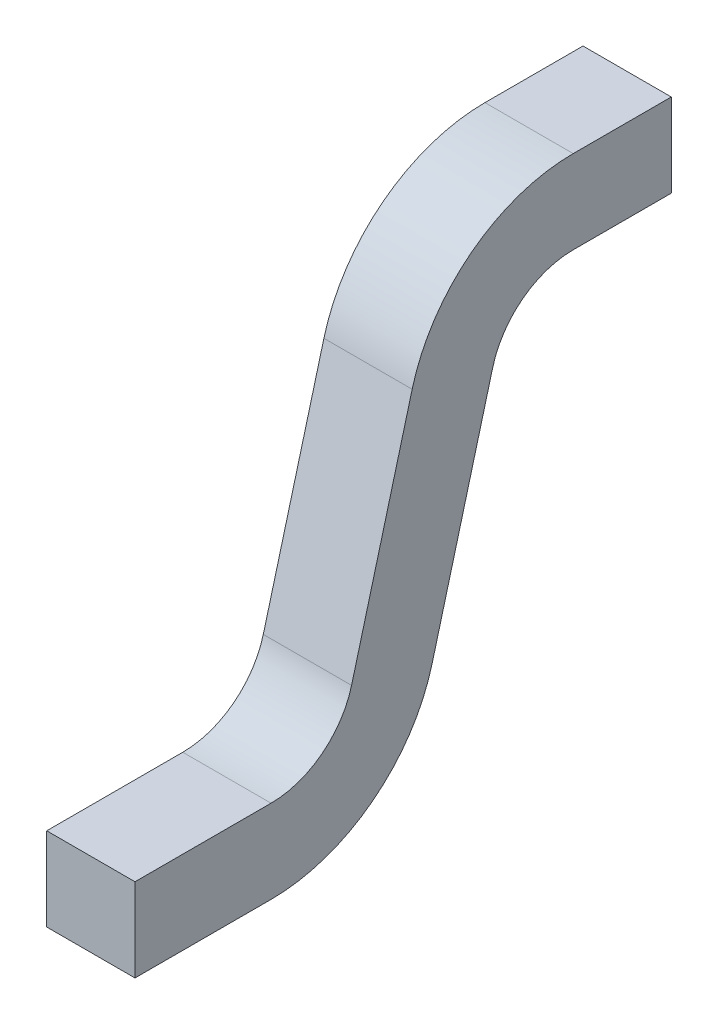
ISO-10303-21;
HEADER;
FILE_DESCRIPTION(('STEP AP214'),'2;1');
FILE_NAME('part.step','',(''),(''),'','','');
FILE_SCHEMA(('AUTOMOTIVE_DESIGN { 1 0 10303 214 1 1 1 1 }'));
ENDSEC;
DATA;
#1=APPLICATION_CONTEXT('core data for automotive mechanical design processes');
#2=APPLICATION_PROTOCOL_DEFINITION('international standard','automotive_design',2000,#1);
#3=PRODUCT_CONTEXT('',#1,'mechanical');
#4=PRODUCT('Part','Part','',(#3));
#5=PRODUCT_RELATED_PRODUCT_CATEGORY('part','',(#4));
#6=PRODUCT_DEFINITION_FORMATION('','',#4);
#7=PRODUCT_DEFINITION_CONTEXT('part definition',#1,'design');
#8=PRODUCT_DEFINITION('design','',#6,#7);
#9=PRODUCT_DEFINITION_SHAPE('','',#8);
#10=(LENGTH_UNIT() NAMED_UNIT(*) SI_UNIT(.MILLI.,.METRE.));
#11=(NAMED_UNIT(*) PLANE_ANGLE_UNIT() SI_UNIT($,.RADIAN.));
#12=(NAMED_UNIT(*) SI_UNIT($,.STERADIAN.) SOLID_ANGLE_UNIT());
#13=UNCERTAINTY_MEASURE_WITH_UNIT(LENGTH_MEASURE(1.E-05),#10,'distance_accuracy_value','');
#14=(GEOMETRIC_REPRESENTATION_CONTEXT(3) GLOBAL_UNCERTAINTY_ASSIGNED_CONTEXT((#13)) GLOBAL_UNIT_ASSIGNED_CONTEXT((#10,
#11,#12)) REPRESENTATION_CONTEXT('',''));
#15=CARTESIAN_POINT('',(0.,0.,0.));
#16=DIRECTION('',(0.,0.,1.));
#17=DIRECTION('',(1.,0.,0.));
#18=AXIS2_PLACEMENT_3D('',#15,#16,#17);
#19=CARTESIAN_POINT('',(-0.0900000000000001,-0.839203393915477,-0.306328844074898));
#20=DIRECTION('',(-1.,0.,0.));
#21=DIRECTION('',(0.,0.,1.));
#22=AXIS2_PLACEMENT_3D('',#19,#20,#21);
#23=PLANE('',#22);
#24=DIRECTION('',(0.,0.,-1.));
#25=VECTOR('',#24,1.);
#26=CARTESIAN_POINT('',(-0.0899999999999999,0.,0.7));
#27=LINE('',#26,#25);
#28=CARTESIAN_POINT('',(-0.0899999999999999,0.,0.2));
#29=VERTEX_POINT('',#28);
#30=CARTESIAN_POINT('',(-0.09,0.,0.));
#31=VERTEX_POINT('',#30);
#32=EDGE_CURVE('E129',#29,#31,#27,.T.);
#33=ORIENTED_EDGE('',*,*,#32,.F.);
#34=CARTESIAN_POINT('',(-0.0899999999999999,-0.17,0.2));
#35=DIRECTION('',(1.,0.,0.));
#36=DIRECTION('',(0.,0.,-1.));
#37=AXIS2_PLACEMENT_3D('',#34,#35,#36);
#38=CIRCLE('',#37,0.17);
#39=CARTESIAN_POINT('',(-0.0899999999999997,-0.126000762332571,0.364207390469142));
#40=VERTEX_POINT('',#39);
#41=EDGE_CURVE('E138',#29,#40,#38,.T.);
#42=ORIENTED_EDGE('',*,*,#41,.T.);
#43=DIRECTION('',(0.,0.965925826289068,-0.258819045102521));
#44=VECTOR('',#43,1.);
#45=CARTESIAN_POINT('',(-0.0899999999999996,-0.39401670399252,0.436022045595592));
#46=LINE('',#45,#44);
#47=CARTESIAN_POINT('',(-0.0899999999999995,-0.587201869250333,0.487785854616096));
#48=VERTEX_POINT('',#47);
#49=EDGE_CURVE('E135',#48,#40,#46,.T.);
#50=ORIENTED_EDGE('',*,*,#49,.F.);
#51=CARTESIAN_POINT('',(-0.0899999999999994,-0.499203393915476,0.816200635554379));
#52=DIRECTION('',(-1.,0.,0.));
#53=DIRECTION('',(0.,-1.,0.));
#54=AXIS2_PLACEMENT_3D('',#51,#52,#53);
#55=CIRCLE('',#54,0.34);
#56=CARTESIAN_POINT('',(-0.0899999999999995,-0.839203393915476,0.816200635554379));
#57=VERTEX_POINT('',#56);
#58=EDGE_CURVE('E170',#57,#48,#55,.F.);
#59=ORIENTED_EDGE('',*,*,#58,.F.);
#60=DIRECTION('',(0.,0.,-1.));
#61=VECTOR('',#60,1.);
#62=CARTESIAN_POINT('',(-0.0899999999999994,-0.839203393915477,0.393671155925102));
#63=LINE('',#62,#61);
#64=CARTESIAN_POINT('',(-0.0899999999999994,-0.839203393915476,1.0936711559251));
#65=VERTEX_POINT('',#64);
#66=EDGE_CURVE('E140',#65,#57,#63,.T.);
#67=ORIENTED_EDGE('',*,*,#66,.F.);
#68=DIRECTION('',(0.,-1.,0.));
#69=VECTOR('',#68,1.);
#70=CARTESIAN_POINT('',(-0.0899999999999994,-0.839203393915476,1.0936711559251));
#71=LINE('',#70,#69);
#72=CARTESIAN_POINT('',(-0.0899999999999994,-0.669203393915476,1.0936711559251));
#73=VERTEX_POINT('',#72);
#74=EDGE_CURVE('E146',#73,#65,#71,.T.);
#75=ORIENTED_EDGE('',*,*,#74,.F.);
#76=DIRECTION('',(0.,0.,1.));
#77=VECTOR('',#76,1.);
#78=CARTESIAN_POINT('',(-0.0899999999999995,-0.669203393915477,0.393671155925102));
#79=LINE('',#78,#77);
#80=CARTESIAN_POINT('',(-0.0899999999999995,-0.669203393915477,0.816200635554379));
#81=VERTEX_POINT('',#80);
#82=EDGE_CURVE('E99',#81,#73,#79,.T.);
#83=ORIENTED_EDGE('',*,*,#82,.F.);
#84=CARTESIAN_POINT('',(-0.0899999999999995,-0.499203393915476,0.816200635554379));
#85=DIRECTION('',(-1.,0.,0.));
#86=DIRECTION('',(0.,-1.,0.));
#87=AXIS2_PLACEMENT_3D('',#84,#85,#86);
#88=CIRCLE('',#87,0.17);
#89=CARTESIAN_POINT('',(-0.0899999999999996,-0.543202631582905,0.651993245085237));
#90=VERTEX_POINT('',#89);
#91=EDGE_CURVE('E19',#81,#90,#88,.F.);
#92=ORIENTED_EDGE('',*,*,#91,.T.);
#93=DIRECTION('',(0.,-0.965925826289068,0.258819045102521));
#94=VECTOR('',#93,1.);
#95=CARTESIAN_POINT('',(-0.0899999999999997,-0.350017466325091,0.600229436064733));
#96=LINE('',#95,#94);
#97=CARTESIAN_POINT('',(-0.0899999999999998,-0.0820015246651428,0.528414780938283));
#98=VERTEX_POINT('',#97);
#99=EDGE_CURVE('E96',#98,#90,#96,.T.);
#100=ORIENTED_EDGE('',*,*,#99,.F.);
#101=CARTESIAN_POINT('',(-0.0899999999999999,-0.17,0.2));
#102=DIRECTION('',(1.,0.,0.));
#103=DIRECTION('',(0.,0.,-1.));
#104=AXIS2_PLACEMENT_3D('',#101,#102,#103);
#105=CIRCLE('',#104,0.34);
#106=CARTESIAN_POINT('',(-0.0899999999999999,0.17,0.2));
#107=VERTEX_POINT('',#106);
#108=EDGE_CURVE('E167',#107,#98,#105,.T.);
#109=ORIENTED_EDGE('',*,*,#108,.F.);
#110=DIRECTION('',(0.,0.,1.));
#111=VECTOR('',#110,1.);
#112=CARTESIAN_POINT('',(-0.09,0.17,0.7));
#113=LINE('',#112,#111);
#114=CARTESIAN_POINT('',(-0.09,0.17,0.));
#115=VERTEX_POINT('',#114);
#116=EDGE_CURVE('E118',#115,#107,#113,.T.);
#117=ORIENTED_EDGE('',*,*,#116,.F.);
#118=DIRECTION('',(0.,1.,0.));
#119=VECTOR('',#118,1.);
#120=CARTESIAN_POINT('',(-0.09,0.,0.));
#121=LINE('',#120,#119);
#122=EDGE_CURVE('E123',#31,#115,#121,.T.);
#123=ORIENTED_EDGE('',*,*,#122,.F.);
#124=EDGE_LOOP('',(#33,#42,#50,#59,#67,#75,#83,#92,#100,#109,#117,#123));
#125=FACE_BOUND('',#124,.T.);
#126=ADVANCED_FACE('F16',(#125),#23,.T.);
#127=CARTESIAN_POINT('',(0.,-0.350017466325091,0.600229436064733));
#128=DIRECTION('',(0.,0.258819045102521,0.965925826289068));
#129=DIRECTION('',(0.,-0.965925826289068,0.258819045102521));
#130=AXIS2_PLACEMENT_3D('',#127,#128,#129);
#131=PLANE('',#130);
#132=DIRECTION('',(-1.,0.,0.));
#133=VECTOR('',#132,1.);
#134=CARTESIAN_POINT('',(-0.267707469156736,-0.543202631582905,0.651993245085238));
#135=LINE('',#134,#133);
#136=CARTESIAN_POINT('',(0.0900000000000002,-0.543202631582905,0.651993245085238));
#137=VERTEX_POINT('',#136);
#138=EDGE_CURVE('E101',#90,#137,#135,.F.);
#139=ORIENTED_EDGE('',*,*,#138,.T.);
#140=DIRECTION('',(0.,-0.965925826289068,0.258819045102522));
#141=VECTOR('',#140,1.);
#142=CARTESIAN_POINT('',(0.0900000000000002,-0.0820015246651429,0.528414780938283));
#143=LINE('',#142,#141);
#144=CARTESIAN_POINT('',(0.0900000000000001,-0.0820015246651426,0.528414780938283));
#145=VERTEX_POINT('',#144);
#146=EDGE_CURVE('E166',#145,#137,#143,.T.);
#147=ORIENTED_EDGE('',*,*,#146,.F.);
#148=DIRECTION('',(1.,0.,0.));
#149=VECTOR('',#148,1.);
#150=CARTESIAN_POINT('',(0.194661618624334,-0.0820015246651427,0.528414780938283));
#151=LINE('',#150,#149);
#152=EDGE_CURVE('E106',#98,#145,#151,.T.);
#153=ORIENTED_EDGE('',*,*,#152,.F.);
#154=ORIENTED_EDGE('',*,*,#99,.T.);
#155=EDGE_LOOP('',(#139,#147,#153,#154));
#156=FACE_BOUND('',#155,.T.);
#157=ADVANCED_FACE('F103',(#156),#131,.T.);
#158=CARTESIAN_POINT('',(-0.267707469156736,-0.499203393915476,0.816200635554379));
#159=DIRECTION('',(-1.,0.,0.));
#160=DIRECTION('',(0.,-1.,0.));
#161=AXIS2_PLACEMENT_3D('',#158,#159,#160);
#162=CYLINDRICAL_SURFACE('',#161,0.17);
#163=CARTESIAN_POINT('',(0.0900000000000002,-0.499203393915476,0.816200635554379));
#164=DIRECTION('',(-1.,0.,0.));
#165=DIRECTION('',(0.,-1.,0.));
#166=AXIS2_PLACEMENT_3D('',#163,#164,#165);
#167=CIRCLE('',#166,0.17);
#168=CARTESIAN_POINT('',(0.0900000000000002,-0.669203393915476,0.816200635554379));
#169=VERTEX_POINT('',#168);
#170=EDGE_CURVE('E111',#137,#169,#167,.T.);
#171=ORIENTED_EDGE('',*,*,#170,.F.);
#172=ORIENTED_EDGE('',*,*,#138,.F.);
#173=ORIENTED_EDGE('',*,*,#91,.F.);
#174=DIRECTION('',(1.,0.,0.));
#175=VECTOR('',#174,1.);
#176=CARTESIAN_POINT('',(0.,-0.669203393915477,0.816200635554379));
#177=LINE('',#176,#175);
#178=EDGE_CURVE('E113',#169,#81,#177,.F.);
#179=ORIENTED_EDGE('',*,*,#178,.F.);
#180=EDGE_LOOP('',(#171,#172,#173,#179));
#181=FACE_BOUND('',#180,.T.);
#182=ADVANCED_FACE('F109',(#181),#162,.F.);
#183=CARTESIAN_POINT('',(0.,-0.669203393915477,0.393671155925102));
#184=DIRECTION('',(0.,1.,0.));
#185=DIRECTION('',(0.,0.,1.));
#186=AXIS2_PLACEMENT_3D('',#183,#184,#185);
#187=PLANE('',#186);
#188=DIRECTION('',(1.,0.,0.));
#189=VECTOR('',#188,1.);
#190=CARTESIAN_POINT('',(-0.0899999999999994,-0.669203393915476,1.0936711559251));
#191=LINE('',#190,#189);
#192=CARTESIAN_POINT('',(0.0900000000000003,-0.669203393915476,1.0936711559251));
#193=VERTEX_POINT('',#192);
#194=EDGE_CURVE('E149',#193,#73,#191,.F.);
#195=ORIENTED_EDGE('',*,*,#194,.F.);
#196=DIRECTION('',(0.,0.,-1.));
#197=VECTOR('',#196,1.);
#198=CARTESIAN_POINT('',(0.0900000000000003,-0.669203393915476,1.0936711559251));
#199=LINE('',#198,#197);
#200=EDGE_CURVE('E165',#169,#193,#199,.F.);
#201=ORIENTED_EDGE('',*,*,#200,.F.);
#202=ORIENTED_EDGE('',*,*,#178,.T.);
#203=ORIENTED_EDGE('',*,*,#82,.T.);
#204=EDGE_LOOP('',(#195,#201,#202,#203));
#205=FACE_BOUND('',#204,.T.);
#206=ADVANCED_FACE('F201',(#205),#187,.T.);
#207=CARTESIAN_POINT('',(-0.0899999999999994,-0.839203393915476,1.0936711559251));
#208=DIRECTION('',(0.,0.,1.));
#209=DIRECTION('',(0.,-1.,0.));
#210=AXIS2_PLACEMENT_3D('',#207,#208,#209);
#211=PLANE('',#210);
#212=ORIENTED_EDGE('',*,*,#194,.T.);
#213=ORIENTED_EDGE('',*,*,#74,.T.);
#214=DIRECTION('',(1.,0.,0.));
#215=VECTOR('',#214,1.);
#216=CARTESIAN_POINT('',(0.,-0.839203393915477,1.0936711559251));
#217=LINE('',#216,#215);
#218=CARTESIAN_POINT('',(0.0900000000000003,-0.839203393915476,1.0936711559251));
#219=VERTEX_POINT('',#218);
#220=EDGE_CURVE('E143',#219,#65,#217,.F.);
#221=ORIENTED_EDGE('',*,*,#220,.F.);
#222=DIRECTION('',(0.,1.,0.));
#223=VECTOR('',#222,1.);
#224=CARTESIAN_POINT('',(0.0900000000000003,-0.839203393915476,1.0936711559251));
#225=LINE('',#224,#223);
#226=EDGE_CURVE('E185',#193,#219,#225,.F.);
#227=ORIENTED_EDGE('',*,*,#226,.F.);
#228=EDGE_LOOP('',(#212,#213,#221,#227));
#229=FACE_BOUND('',#228,.T.);
#230=ADVANCED_FACE('F195',(#229),#211,.T.);
#231=CARTESIAN_POINT('',(0.,-0.839203393915477,0.393671155925102));
#232=DIRECTION('',(0.,-1.,0.));
#233=DIRECTION('',(0.,0.,-1.));
#234=AXIS2_PLACEMENT_3D('',#231,#232,#233);
#235=PLANE('',#234);
#236=ORIENTED_EDGE('',*,*,#220,.T.);
#237=ORIENTED_EDGE('',*,*,#66,.T.);
#238=DIRECTION('',(-1.,0.,0.));
#239=VECTOR('',#238,1.);
#240=CARTESIAN_POINT('',(-0.267707469156736,-0.839203393915476,0.816200635554379));
#241=LINE('',#240,#239);
#242=CARTESIAN_POINT('',(0.0900000000000002,-0.839203393915476,0.816200635554379));
#243=VERTEX_POINT('',#242);
#244=EDGE_CURVE('E142',#243,#57,#241,.T.);
#245=ORIENTED_EDGE('',*,*,#244,.F.);
#246=DIRECTION('',(0.,0.,-1.));
#247=VECTOR('',#246,1.);
#248=CARTESIAN_POINT('',(0.0900000000000003,-0.839203393915476,1.0936711559251));
#249=LINE('',#248,#247);
#250=EDGE_CURVE('E163',#219,#243,#249,.T.);
#251=ORIENTED_EDGE('',*,*,#250,.F.);
#252=EDGE_LOOP('',(#236,#237,#245,#251));
#253=FACE_BOUND('',#252,.T.);
#254=ADVANCED_FACE('F266',(#253),#235,.T.);
#255=CARTESIAN_POINT('',(-0.267707469156736,-0.499203393915476,0.816200635554379));
#256=DIRECTION('',(-1.,0.,0.));
#257=DIRECTION('',(0.,-1.,0.));
#258=AXIS2_PLACEMENT_3D('',#255,#256,#257);
#259=CYLINDRICAL_SURFACE('',#258,0.34);
#260=DIRECTION('',(1.,0.,0.));
#261=VECTOR('',#260,1.);
#262=CARTESIAN_POINT('',(0.,-0.587201869250334,0.487785854616096));
#263=LINE('',#262,#261);
#264=CARTESIAN_POINT('',(0.0900000000000001,-0.587201869250333,0.487785854616096));
#265=VERTEX_POINT('',#264);
#266=EDGE_CURVE('E139',#265,#48,#263,.F.);
#267=ORIENTED_EDGE('',*,*,#266,.F.);
#268=CARTESIAN_POINT('',(0.0900000000000002,-0.499203393915476,0.816200635554379));
#269=DIRECTION('',(-1.,0.,0.));
#270=DIRECTION('',(0.,-1.,0.));
#271=AXIS2_PLACEMENT_3D('',#268,#269,#270);
#272=CIRCLE('',#271,0.34);
#273=EDGE_CURVE('E160',#243,#265,#272,.F.);
#274=ORIENTED_EDGE('',*,*,#273,.F.);
#275=ORIENTED_EDGE('',*,*,#244,.T.);
#276=ORIENTED_EDGE('',*,*,#58,.T.);
#277=EDGE_LOOP('',(#267,#274,#275,#276));
#278=FACE_BOUND('',#277,.T.);
#279=ADVANCED_FACE('F263',(#278),#259,.T.);
#280=CARTESIAN_POINT('',(0.,-0.39401670399252,0.436022045595592));
#281=DIRECTION('',(0.,-0.258819045102521,-0.965925826289068));
#282=DIRECTION('',(0.,0.965925826289068,-0.258819045102521));
#283=AXIS2_PLACEMENT_3D('',#280,#281,#282);
#284=PLANE('',#283);
#285=ORIENTED_EDGE('',*,*,#266,.T.);
#286=ORIENTED_EDGE('',*,*,#49,.T.);
#287=DIRECTION('',(1.,0.,0.));
#288=VECTOR('',#287,1.);
#289=CARTESIAN_POINT('',(0.194661618624334,-0.126000762332571,0.364207390469142));
#290=LINE('',#289,#288);
#291=CARTESIAN_POINT('',(0.0900000000000001,-0.126000762332571,0.364207390469142));
#292=VERTEX_POINT('',#291);
#293=EDGE_CURVE('E169',#40,#292,#290,.T.);
#294=ORIENTED_EDGE('',*,*,#293,.T.);
#295=DIRECTION('',(0.,0.965925826289068,-0.25881904510252));
#296=VECTOR('',#295,1.);
#297=CARTESIAN_POINT('',(0.0900000000000001,-0.587201869250334,0.487785854616096));
#298=LINE('',#297,#296);
#299=EDGE_CURVE('E159',#265,#292,#298,.T.);
#300=ORIENTED_EDGE('',*,*,#299,.F.);
#301=EDGE_LOOP('',(#285,#286,#294,#300));
#302=FACE_BOUND('',#301,.T.);
#303=ADVANCED_FACE('F236',(#302),#284,.T.);
#304=CARTESIAN_POINT('',(0.194661618624334,-0.17,0.2));
#305=DIRECTION('',(1.,0.,0.));
#306=DIRECTION('',(0.,0.,-1.));
#307=AXIS2_PLACEMENT_3D('',#304,#305,#306);
#308=CYLINDRICAL_SURFACE('',#307,0.17);
#309=ORIENTED_EDGE('',*,*,#41,.F.);
#310=DIRECTION('',(1.,0.,0.));
#311=VECTOR('',#310,1.);
#312=CARTESIAN_POINT('',(0.,0.,0.2));
#313=LINE('',#312,#311);
#314=CARTESIAN_POINT('',(0.0900000000000001,0.,0.2));
#315=VERTEX_POINT('',#314);
#316=EDGE_CURVE('E132',#315,#29,#313,.F.);
#317=ORIENTED_EDGE('',*,*,#316,.F.);
#318=CARTESIAN_POINT('',(0.0900000000000001,-0.17,0.2));
#319=DIRECTION('',(1.,0.,0.));
#320=DIRECTION('',(0.,0.,-1.));
#321=AXIS2_PLACEMENT_3D('',#318,#319,#320);
#322=CIRCLE('',#321,0.17);
#323=EDGE_CURVE('E155',#292,#315,#322,.F.);
#324=ORIENTED_EDGE('',*,*,#323,.F.);
#325=ORIENTED_EDGE('',*,*,#293,.F.);
#326=EDGE_LOOP('',(#309,#317,#324,#325));
#327=FACE_BOUND('',#326,.T.);
#328=ADVANCED_FACE('F239',(#327),#308,.F.);
#329=CARTESIAN_POINT('',(0.,0.,0.7));
#330=DIRECTION('',(0.,-1.,0.));
#331=DIRECTION('',(0.,0.,-1.));
#332=AXIS2_PLACEMENT_3D('',#329,#330,#331);
#333=PLANE('',#332);
#334=DIRECTION('',(-1.,0.,0.));
#335=VECTOR('',#334,1.);
#336=CARTESIAN_POINT('',(0.09,0.,0.));
#337=LINE('',#336,#335);
#338=CARTESIAN_POINT('',(0.0900000000000001,0.,0.));
#339=VERTEX_POINT('',#338);
#340=EDGE_CURVE('E126',#339,#31,#337,.T.);
#341=ORIENTED_EDGE('',*,*,#340,.F.);
#342=DIRECTION('',(0.,0.,-1.));
#343=VECTOR('',#342,1.);
#344=CARTESIAN_POINT('',(0.0900000000000004,0.,1.0936711559251));
#345=LINE('',#344,#343);
#346=EDGE_CURVE('E158',#315,#339,#345,.T.);
#347=ORIENTED_EDGE('',*,*,#346,.F.);
#348=ORIENTED_EDGE('',*,*,#316,.T.);
#349=ORIENTED_EDGE('',*,*,#32,.T.);
#350=EDGE_LOOP('',(#341,#347,#348,#349));
#351=FACE_BOUND('',#350,.T.);
#352=ADVANCED_FACE('F262',(#351),#333,.T.);
#353=CARTESIAN_POINT('',(0.09,0.,0.));
#354=DIRECTION('',(0.,0.,-1.));
#355=DIRECTION('',(-1.,0.,0.));
#356=AXIS2_PLACEMENT_3D('',#353,#354,#355);
#357=PLANE('',#356);
#358=DIRECTION('',(1.,0.,0.));
#359=VECTOR('',#358,1.);
#360=CARTESIAN_POINT('',(0.,0.17,0.));
#361=LINE('',#360,#359);
#362=CARTESIAN_POINT('',(0.0900000000000001,0.17,0.));
#363=VERTEX_POINT('',#362);
#364=EDGE_CURVE('E120',#363,#115,#361,.F.);
#365=ORIENTED_EDGE('',*,*,#364,.F.);
#366=DIRECTION('',(0.,1.,0.));
#367=VECTOR('',#366,1.);
#368=CARTESIAN_POINT('',(0.09,-0.839203393915476,0.));
#369=LINE('',#368,#367);
#370=EDGE_CURVE('E224',#339,#363,#369,.T.);
#371=ORIENTED_EDGE('',*,*,#370,.F.);
#372=ORIENTED_EDGE('',*,*,#340,.T.);
#373=ORIENTED_EDGE('',*,*,#122,.T.);
#374=EDGE_LOOP('',(#365,#371,#372,#373));
#375=FACE_BOUND('',#374,.T.);
#376=ADVANCED_FACE('F212',(#375),#357,.T.);
#377=CARTESIAN_POINT('',(0.,0.17,0.7));
#378=DIRECTION('',(0.,1.,0.));
#379=DIRECTION('',(0.,0.,1.));
#380=AXIS2_PLACEMENT_3D('',#377,#378,#379);
#381=PLANE('',#380);
#382=ORIENTED_EDGE('',*,*,#364,.T.);
#383=ORIENTED_EDGE('',*,*,#116,.T.);
#384=DIRECTION('',(1.,0.,0.));
#385=VECTOR('',#384,1.);
#386=CARTESIAN_POINT('',(0.194661618624334,0.17,0.2));
#387=LINE('',#386,#385);
#388=CARTESIAN_POINT('',(0.0900000000000001,0.17,0.2));
#389=VERTEX_POINT('',#388);
#390=EDGE_CURVE('E34',#389,#107,#387,.F.);
#391=ORIENTED_EDGE('',*,*,#390,.F.);
#392=DIRECTION('',(0.,0.,-1.));
#393=VECTOR('',#392,1.);
#394=CARTESIAN_POINT('',(0.0900000000000004,0.17,1.0936711559251));
#395=LINE('',#394,#393);
#396=EDGE_CURVE('E25',#363,#389,#395,.F.);
#397=ORIENTED_EDGE('',*,*,#396,.F.);
#398=EDGE_LOOP('',(#382,#383,#391,#397));
#399=FACE_BOUND('',#398,.T.);
#400=ADVANCED_FACE('F215',(#399),#381,.T.);
#401=CARTESIAN_POINT('',(0.194661618624334,-0.17,0.2));
#402=DIRECTION('',(1.,0.,0.));
#403=DIRECTION('',(0.,0.,-1.));
#404=AXIS2_PLACEMENT_3D('',#401,#402,#403);
#405=CYLINDRICAL_SURFACE('',#404,0.34);
#406=ORIENTED_EDGE('',*,*,#390,.T.);
#407=ORIENTED_EDGE('',*,*,#108,.T.);
#408=ORIENTED_EDGE('',*,*,#152,.T.);
#409=CARTESIAN_POINT('',(0.0900000000000001,-0.17,0.2));
#410=DIRECTION('',(1.,0.,0.));
#411=DIRECTION('',(0.,0.,-1.));
#412=AXIS2_PLACEMENT_3D('',#409,#410,#411);
#413=CIRCLE('',#412,0.34);
#414=EDGE_CURVE('E11',#389,#145,#413,.T.);
#415=ORIENTED_EDGE('',*,*,#414,.F.);
#416=EDGE_LOOP('',(#406,#407,#408,#415));
#417=FACE_BOUND('',#416,.T.);
#418=ADVANCED_FACE('F257',(#417),#405,.T.);
#419=CARTESIAN_POINT('',(0.0900000000000003,-0.839203393915476,1.0936711559251));
#420=DIRECTION('',(1.,0.,0.));
#421=DIRECTION('',(0.,0.,-1.));
#422=AXIS2_PLACEMENT_3D('',#419,#420,#421);
#423=PLANE('',#422);
#424=ORIENTED_EDGE('',*,*,#396,.T.);
#425=ORIENTED_EDGE('',*,*,#414,.T.);
#426=ORIENTED_EDGE('',*,*,#146,.T.);
#427=ORIENTED_EDGE('',*,*,#170,.T.);
#428=ORIENTED_EDGE('',*,*,#200,.T.);
#429=ORIENTED_EDGE('',*,*,#226,.T.);
#430=ORIENTED_EDGE('',*,*,#250,.T.);
#431=ORIENTED_EDGE('',*,*,#273,.T.);
#432=ORIENTED_EDGE('',*,*,#299,.T.);
#433=ORIENTED_EDGE('',*,*,#323,.T.);
#434=ORIENTED_EDGE('',*,*,#346,.T.);
#435=ORIENTED_EDGE('',*,*,#370,.T.);
#436=EDGE_LOOP('',(#424,#425,#426,#427,#428,#429,#430,#431,#432,#433,#434,#435));
#437=FACE_BOUND('',#436,.T.);
#438=ADVANCED_FACE('F243',(#437),#423,.T.);
#439=CLOSED_SHELL('',(#126,#157,#182,#206,#230,#254,#279,#303,#328,#352,#376,#400,#418,#438));
#440=MANIFOLD_SOLID_BREP('B1',#439);
#441=ADVANCED_BREP_SHAPE_REPRESENTATION('',(#18,#440),#14);
#442=SHAPE_DEFINITION_REPRESENTATION(#9,#441);
ENDSEC;
END-ISO-10303-21;
